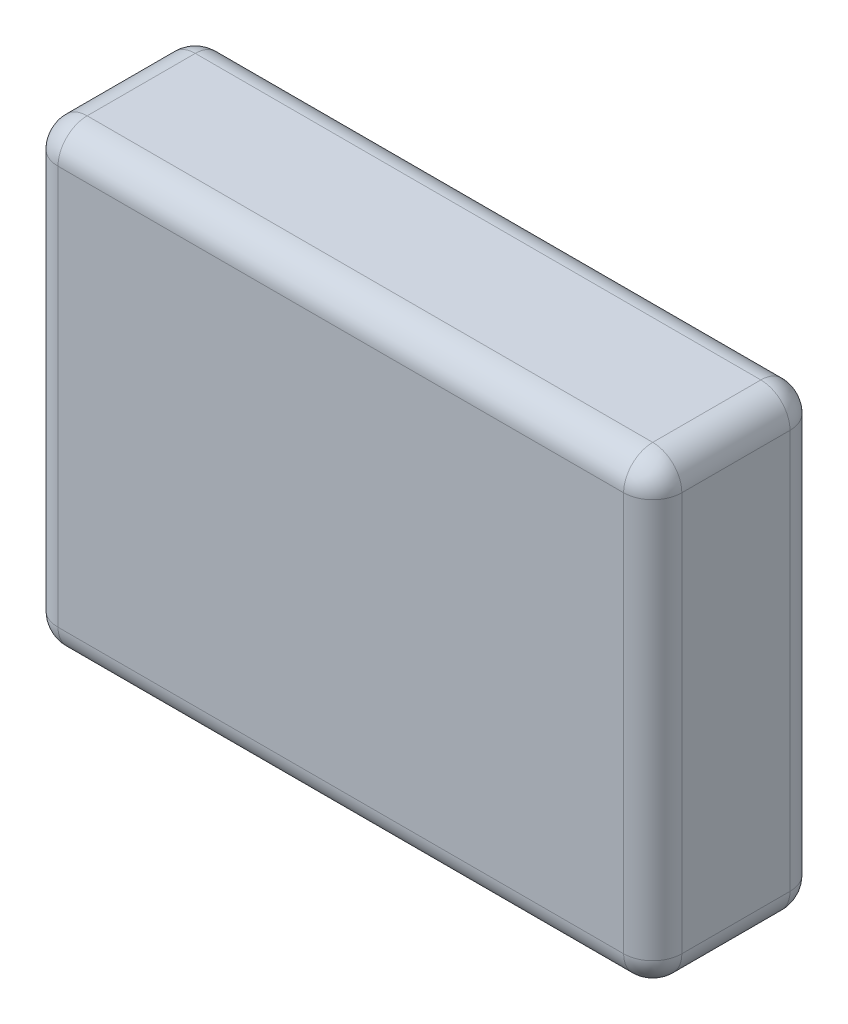
ISO-10303-21;
HEADER;
FILE_DESCRIPTION(('STEP AP214'),'2;1');
FILE_NAME('part.step','',(''),(''),'','','');
FILE_SCHEMA(('AUTOMOTIVE_DESIGN { 1 0 10303 214 1 1 1 1 }'));
ENDSEC;
DATA;
#1=APPLICATION_CONTEXT('core data for automotive mechanical design processes');
#2=APPLICATION_PROTOCOL_DEFINITION('international standard','automotive_design',2000,#1);
#3=PRODUCT_CONTEXT('',#1,'mechanical');
#4=PRODUCT('Part','Part','',(#3));
#5=PRODUCT_RELATED_PRODUCT_CATEGORY('part','',(#4));
#6=PRODUCT_DEFINITION_FORMATION('','',#4);
#7=PRODUCT_DEFINITION_CONTEXT('part definition',#1,'design');
#8=PRODUCT_DEFINITION('design','',#6,#7);
#9=PRODUCT_DEFINITION_SHAPE('','',#8);
#10=(LENGTH_UNIT() NAMED_UNIT(*) SI_UNIT(.MILLI.,.METRE.));
#11=(NAMED_UNIT(*) PLANE_ANGLE_UNIT() SI_UNIT($,.RADIAN.));
#12=(NAMED_UNIT(*) SI_UNIT($,.STERADIAN.) SOLID_ANGLE_UNIT());
#13=UNCERTAINTY_MEASURE_WITH_UNIT(LENGTH_MEASURE(1.E-05),#10,'distance_accuracy_value','');
#14=(GEOMETRIC_REPRESENTATION_CONTEXT(3) GLOBAL_UNCERTAINTY_ASSIGNED_CONTEXT((#13)) GLOBAL_UNIT_ASSIGNED_CONTEXT((#10,
#11,#12)) REPRESENTATION_CONTEXT('',''));
#15=CARTESIAN_POINT('',(0.,0.,0.));
#16=DIRECTION('',(0.,0.,1.));
#17=DIRECTION('',(1.,0.,0.));
#18=AXIS2_PLACEMENT_3D('',#15,#16,#17);
#19=CARTESIAN_POINT('',(375.,172.271573604061,200.));
#20=DIRECTION('',(-1.,0.,0.));
#21=DIRECTION('',(0.,0.,1.));
#22=AXIS2_PLACEMENT_3D('',#19,#20,#21);
#23=PLANE('',#22);
#24=DIRECTION('',(0.,0.,-1.));
#25=VECTOR('',#24,1.);
#26=CARTESIAN_POINT('',(375.,137.271573604061,200.));
#27=LINE('',#26,#25);
#28=CARTESIAN_POINT('',(375.,137.271573604061,35.));
#29=VERTEX_POINT('',#28);
#30=CARTESIAN_POINT('',(375.,137.271573604061,165.));
#31=VERTEX_POINT('',#30);
#32=EDGE_CURVE('E141',#29,#31,#27,.F.);
#33=ORIENTED_EDGE('',*,*,#32,.T.);
#34=DIRECTION('',(0.,1.,0.));
#35=VECTOR('',#34,1.);
#36=CARTESIAN_POINT('',(375.,-377.728426395939,165.));
#37=LINE('',#36,#35);
#38=CARTESIAN_POINT('',(375.,-342.728426395939,165.));
#39=VERTEX_POINT('',#38);
#40=EDGE_CURVE('E187',#31,#39,#37,.F.);
#41=ORIENTED_EDGE('',*,*,#40,.T.);
#42=DIRECTION('',(0.,0.,-1.));
#43=VECTOR('',#42,1.);
#44=CARTESIAN_POINT('',(375.,-342.728426395939,200.));
#45=LINE('',#44,#43);
#46=CARTESIAN_POINT('',(375.,-342.728426395939,35.));
#47=VERTEX_POINT('',#46);
#48=EDGE_CURVE('E182',#39,#47,#45,.T.);
#49=ORIENTED_EDGE('',*,*,#48,.T.);
#50=DIRECTION('',(0.,1.,0.));
#51=VECTOR('',#50,1.);
#52=CARTESIAN_POINT('',(375.,172.271573604061,35.));
#53=LINE('',#52,#51);
#54=EDGE_CURVE('E176',#47,#29,#53,.T.);
#55=ORIENTED_EDGE('',*,*,#54,.T.);
#56=EDGE_LOOP('',(#33,#41,#49,#55));
#57=FACE_BOUND('',#56,.T.);
#58=ADVANCED_FACE('F45',(#57),#23,.F.);
#59=CARTESIAN_POINT('',(-375.,172.271573604061,200.));
#60=DIRECTION('',(0.,-1.,0.));
#61=DIRECTION('',(0.,0.,-1.));
#62=AXIS2_PLACEMENT_3D('',#59,#60,#61);
#63=PLANE('',#62);
#64=DIRECTION('',(0.,0.,-1.));
#65=VECTOR('',#64,1.);
#66=CARTESIAN_POINT('',(-340.,172.271573604061,200.));
#67=LINE('',#66,#65);
#68=CARTESIAN_POINT('',(-340.,172.271573604061,35.));
#69=VERTEX_POINT('',#68);
#70=CARTESIAN_POINT('',(-340.,172.271573604061,165.));
#71=VERTEX_POINT('',#70);
#72=EDGE_CURVE('E166',#69,#71,#67,.F.);
#73=ORIENTED_EDGE('',*,*,#72,.T.);
#74=DIRECTION('',(-1.,0.,0.));
#75=VECTOR('',#74,1.);
#76=CARTESIAN_POINT('',(375.,172.271573604061,165.));
#77=LINE('',#76,#75);
#78=CARTESIAN_POINT('',(340.,172.271573604061,165.));
#79=VERTEX_POINT('',#78);
#80=EDGE_CURVE('E170',#71,#79,#77,.F.);
#81=ORIENTED_EDGE('',*,*,#80,.T.);
#82=DIRECTION('',(0.,0.,-1.));
#83=VECTOR('',#82,1.);
#84=CARTESIAN_POINT('',(340.,172.271573604061,200.));
#85=LINE('',#84,#83);
#86=CARTESIAN_POINT('',(340.,172.271573604061,35.));
#87=VERTEX_POINT('',#86);
#88=EDGE_CURVE('E139',#79,#87,#85,.T.);
#89=ORIENTED_EDGE('',*,*,#88,.T.);
#90=DIRECTION('',(-1.,0.,0.));
#91=VECTOR('',#90,1.);
#92=CARTESIAN_POINT('',(-375.,172.271573604061,35.));
#93=LINE('',#92,#91);
#94=EDGE_CURVE('E159',#87,#69,#93,.T.);
#95=ORIENTED_EDGE('',*,*,#94,.T.);
#96=EDGE_LOOP('',(#73,#81,#89,#95));
#97=FACE_BOUND('',#96,.T.);
#98=ADVANCED_FACE('F168',(#97),#63,.F.);
#99=CARTESIAN_POINT('',(-375.,172.271573604061,200.));
#100=DIRECTION('',(1.,0.,0.));
#101=DIRECTION('',(0.,0.,-1.));
#102=AXIS2_PLACEMENT_3D('',#99,#100,#101);
#103=PLANE('',#102);
#104=DIRECTION('',(0.,0.,-1.));
#105=VECTOR('',#104,1.);
#106=CARTESIAN_POINT('',(-375.,-342.728426395939,200.));
#107=LINE('',#106,#105);
#108=CARTESIAN_POINT('',(-375.,-342.728426395939,35.));
#109=VERTEX_POINT('',#108);
#110=CARTESIAN_POINT('',(-375.,-342.728426395939,165.));
#111=VERTEX_POINT('',#110);
#112=EDGE_CURVE('E193',#109,#111,#107,.F.);
#113=ORIENTED_EDGE('',*,*,#112,.T.);
#114=DIRECTION('',(0.,-1.,0.));
#115=VECTOR('',#114,1.);
#116=CARTESIAN_POINT('',(-375.,172.271573604061,165.));
#117=LINE('',#116,#115);
#118=CARTESIAN_POINT('',(-375.,137.271573604061,165.));
#119=VERTEX_POINT('',#118);
#120=EDGE_CURVE('E200',#111,#119,#117,.F.);
#121=ORIENTED_EDGE('',*,*,#120,.T.);
#122=DIRECTION('',(0.,0.,-1.));
#123=VECTOR('',#122,1.);
#124=CARTESIAN_POINT('',(-375.,137.271573604061,200.));
#125=LINE('',#124,#123);
#126=CARTESIAN_POINT('',(-375.,137.271573604061,35.));
#127=VERTEX_POINT('',#126);
#128=EDGE_CURVE('E196',#119,#127,#125,.T.);
#129=ORIENTED_EDGE('',*,*,#128,.T.);
#130=DIRECTION('',(0.,-1.,0.));
#131=VECTOR('',#130,1.);
#132=CARTESIAN_POINT('',(-375.,172.271573604061,35.));
#133=LINE('',#132,#131);
#134=EDGE_CURVE('E190',#127,#109,#133,.T.);
#135=ORIENTED_EDGE('',*,*,#134,.T.);
#136=EDGE_LOOP('',(#113,#121,#129,#135));
#137=FACE_BOUND('',#136,.T.);
#138=ADVANCED_FACE('F339',(#137),#103,.F.);
#139=CARTESIAN_POINT('',(-375.,-377.728426395939,200.));
#140=DIRECTION('',(0.,1.,0.));
#141=DIRECTION('',(0.,0.,1.));
#142=AXIS2_PLACEMENT_3D('',#139,#140,#141);
#143=PLANE('',#142);
#144=DIRECTION('',(0.,0.,-1.));
#145=VECTOR('',#144,1.);
#146=CARTESIAN_POINT('',(340.,-377.728426395939,200.));
#147=LINE('',#146,#145);
#148=CARTESIAN_POINT('',(340.,-377.728426395939,35.));
#149=VERTEX_POINT('',#148);
#150=CARTESIAN_POINT('',(340.,-377.728426395939,165.));
#151=VERTEX_POINT('',#150);
#152=EDGE_CURVE('E206',#149,#151,#147,.F.);
#153=ORIENTED_EDGE('',*,*,#152,.T.);
#154=DIRECTION('',(1.,0.,0.));
#155=VECTOR('',#154,1.);
#156=CARTESIAN_POINT('',(-375.,-377.728426395939,165.));
#157=LINE('',#156,#155);
#158=CARTESIAN_POINT('',(-340.,-377.728426395939,165.));
#159=VERTEX_POINT('',#158);
#160=EDGE_CURVE('E213',#151,#159,#157,.F.);
#161=ORIENTED_EDGE('',*,*,#160,.T.);
#162=DIRECTION('',(0.,0.,-1.));
#163=VECTOR('',#162,1.);
#164=CARTESIAN_POINT('',(-340.,-377.728426395939,200.));
#165=LINE('',#164,#163);
#166=CARTESIAN_POINT('',(-340.,-377.728426395939,35.));
#167=VERTEX_POINT('',#166);
#168=EDGE_CURVE('E209',#159,#167,#165,.T.);
#169=ORIENTED_EDGE('',*,*,#168,.T.);
#170=DIRECTION('',(1.,0.,0.));
#171=VECTOR('',#170,1.);
#172=CARTESIAN_POINT('',(-375.,-377.728426395939,35.));
#173=LINE('',#172,#171);
#174=EDGE_CURVE('E203',#167,#149,#173,.T.);
#175=ORIENTED_EDGE('',*,*,#174,.T.);
#176=EDGE_LOOP('',(#153,#161,#169,#175));
#177=FACE_BOUND('',#176,.T.);
#178=ADVANCED_FACE('F349',(#177),#143,.F.);
#179=CARTESIAN_POINT('',(0.,0.,200.));
#180=DIRECTION('',(0.,0.,1.));
#181=DIRECTION('',(1.,0.,0.));
#182=AXIS2_PLACEMENT_3D('',#179,#180,#181);
#183=PLANE('',#182);
#184=DIRECTION('',(0.,-1.,0.));
#185=VECTOR('',#184,1.);
#186=CARTESIAN_POINT('',(-340.,-377.728426395939,200.));
#187=LINE('',#186,#185);
#188=CARTESIAN_POINT('',(-340.,137.271573604061,200.));
#189=VERTEX_POINT('',#188);
#190=CARTESIAN_POINT('',(-340.,-342.728426395939,200.));
#191=VERTEX_POINT('',#190);
#192=EDGE_CURVE('E222',#189,#191,#187,.T.);
#193=ORIENTED_EDGE('',*,*,#192,.T.);
#194=DIRECTION('',(1.,0.,0.));
#195=VECTOR('',#194,1.);
#196=CARTESIAN_POINT('',(375.,-342.728426395939,200.));
#197=LINE('',#196,#195);
#198=CARTESIAN_POINT('',(340.,-342.728426395939,200.));
#199=VERTEX_POINT('',#198);
#200=EDGE_CURVE('E225',#191,#199,#197,.T.);
#201=ORIENTED_EDGE('',*,*,#200,.T.);
#202=DIRECTION('',(0.,1.,0.));
#203=VECTOR('',#202,1.);
#204=CARTESIAN_POINT('',(340.,172.271573604061,200.));
#205=LINE('',#204,#203);
#206=CARTESIAN_POINT('',(340.,137.271573604061,200.));
#207=VERTEX_POINT('',#206);
#208=EDGE_CURVE('E216',#199,#207,#205,.T.);
#209=ORIENTED_EDGE('',*,*,#208,.T.);
#210=DIRECTION('',(-1.,0.,0.));
#211=VECTOR('',#210,1.);
#212=CARTESIAN_POINT('',(-375.,137.271573604061,200.));
#213=LINE('',#212,#211);
#214=EDGE_CURVE('E219',#207,#189,#213,.T.);
#215=ORIENTED_EDGE('',*,*,#214,.T.);
#216=EDGE_LOOP('',(#193,#201,#209,#215));
#217=FACE_BOUND('',#216,.T.);
#218=ADVANCED_FACE('F331',(#217),#183,.T.);
#219=CARTESIAN_POINT('',(0.,0.,0.));
#220=DIRECTION('',(0.,0.,1.));
#221=DIRECTION('',(1.,0.,0.));
#222=AXIS2_PLACEMENT_3D('',#219,#220,#221);
#223=PLANE('',#222);
#224=DIRECTION('',(0.,1.,0.));
#225=VECTOR('',#224,1.);
#226=CARTESIAN_POINT('',(340.,0.,0.));
#227=LINE('',#226,#225);
#228=CARTESIAN_POINT('',(340.,137.271573604061,0.));
#229=VERTEX_POINT('',#228);
#230=CARTESIAN_POINT('',(340.,-342.728426395939,0.));
#231=VERTEX_POINT('',#230);
#232=EDGE_CURVE('E229',#229,#231,#227,.F.);
#233=ORIENTED_EDGE('',*,*,#232,.T.);
#234=DIRECTION('',(1.,0.,0.));
#235=VECTOR('',#234,1.);
#236=CARTESIAN_POINT('',(0.,-342.728426395939,0.));
#237=LINE('',#236,#235);
#238=CARTESIAN_POINT('',(-340.,-342.728426395939,0.));
#239=VERTEX_POINT('',#238);
#240=EDGE_CURVE('E11',#231,#239,#237,.F.);
#241=ORIENTED_EDGE('',*,*,#240,.T.);
#242=DIRECTION('',(0.,-1.,0.));
#243=VECTOR('',#242,1.);
#244=CARTESIAN_POINT('',(-340.,0.,0.));
#245=LINE('',#244,#243);
#246=CARTESIAN_POINT('',(-340.,137.271573604061,0.));
#247=VERTEX_POINT('',#246);
#248=EDGE_CURVE('E55',#239,#247,#245,.F.);
#249=ORIENTED_EDGE('',*,*,#248,.T.);
#250=DIRECTION('',(-1.,0.,0.));
#251=VECTOR('',#250,1.);
#252=CARTESIAN_POINT('',(0.,137.271573604061,0.));
#253=LINE('',#252,#251);
#254=EDGE_CURVE('E232',#247,#229,#253,.F.);
#255=ORIENTED_EDGE('',*,*,#254,.T.);
#256=EDGE_LOOP('',(#233,#241,#249,#255));
#257=FACE_BOUND('',#256,.T.);
#258=ADVANCED_FACE('F577',(#257),#223,.F.);
#259=CARTESIAN_POINT('',(-340.,-342.728426395939,200.));
#260=DIRECTION('',(0.,0.,-1.));
#261=DIRECTION('',(-1.,0.,0.));
#262=AXIS2_PLACEMENT_3D('',#259,#260,#261);
#263=CYLINDRICAL_SURFACE('',#262,35.);
#264=CARTESIAN_POINT('',(-340.,-342.728426395939,165.));
#265=DIRECTION('',(0.,0.,1.));
#266=DIRECTION('',(1.,0.,0.));
#267=AXIS2_PLACEMENT_3D('',#264,#265,#266);
#268=CIRCLE('',#267,35.);
#269=EDGE_CURVE('E49',#111,#159,#268,.T.);
#270=ORIENTED_EDGE('',*,*,#269,.F.);
#271=ORIENTED_EDGE('',*,*,#112,.F.);
#272=CARTESIAN_POINT('',(-340.,-342.728426395939,35.));
#273=DIRECTION('',(0.,0.,-1.));
#274=DIRECTION('',(-1.,0.,0.));
#275=AXIS2_PLACEMENT_3D('',#272,#273,#274);
#276=CIRCLE('',#275,35.);
#277=EDGE_CURVE('E307',#167,#109,#276,.T.);
#278=ORIENTED_EDGE('',*,*,#277,.F.);
#279=ORIENTED_EDGE('',*,*,#168,.F.);
#280=EDGE_LOOP('',(#270,#271,#278,#279));
#281=FACE_BOUND('',#280,.T.);
#282=ADVANCED_FACE('F47',(#281),#263,.T.);
#283=CARTESIAN_POINT('',(-340.,-342.728426395939,165.));
#284=DIRECTION('',(0.,-1.,0.));
#285=DIRECTION('',(0.,0.,-1.));
#286=AXIS2_PLACEMENT_3D('',#283,#284,#285);
#287=SPHERICAL_SURFACE('',#286,35.);
#288=CARTESIAN_POINT('',(-340.,-342.728426395939,165.));
#289=DIRECTION('',(0.,-1.,0.));
#290=DIRECTION('',(0.,0.,-1.));
#291=AXIS2_PLACEMENT_3D('',#288,#289,#290);
#292=CIRCLE('',#291,35.);
#293=EDGE_CURVE('E300',#111,#191,#292,.F.);
#294=ORIENTED_EDGE('',*,*,#293,.F.);
#295=ORIENTED_EDGE('',*,*,#269,.T.);
#296=CARTESIAN_POINT('',(-340.,-342.728426395939,165.));
#297=DIRECTION('',(-1.,0.,0.));
#298=DIRECTION('',(0.,0.,1.));
#299=AXIS2_PLACEMENT_3D('',#296,#297,#298);
#300=CIRCLE('',#299,35.);
#301=EDGE_CURVE('E304',#191,#159,#300,.F.);
#302=ORIENTED_EDGE('',*,*,#301,.F.);
#303=EDGE_LOOP('',(#294,#295,#302));
#304=FACE_BOUND('',#303,.T.);
#305=ADVANCED_FACE('F319',(#304),#287,.T.);
#306=CARTESIAN_POINT('',(-340.,-342.728426395939,35.));
#307=DIRECTION('',(-1.,0.,0.));
#308=DIRECTION('',(0.,0.,1.));
#309=AXIS2_PLACEMENT_3D('',#306,#307,#308);
#310=SPHERICAL_SURFACE('',#309,35.);
#311=CARTESIAN_POINT('',(-340.,-342.728426395939,35.));
#312=DIRECTION('',(-1.,0.,0.));
#313=DIRECTION('',(0.,0.,1.));
#314=AXIS2_PLACEMENT_3D('',#311,#312,#313);
#315=CIRCLE('',#314,35.);
#316=EDGE_CURVE('E293',#167,#239,#315,.F.);
#317=ORIENTED_EDGE('',*,*,#316,.F.);
#318=ORIENTED_EDGE('',*,*,#277,.T.);
#319=CARTESIAN_POINT('',(-340.,-342.728426395939,35.));
#320=DIRECTION('',(0.,-1.,0.));
#321=DIRECTION('',(0.,0.,-1.));
#322=AXIS2_PLACEMENT_3D('',#319,#320,#321);
#323=CIRCLE('',#322,35.);
#324=EDGE_CURVE('E297',#239,#109,#323,.F.);
#325=ORIENTED_EDGE('',*,*,#324,.F.);
#326=EDGE_LOOP('',(#317,#318,#325));
#327=FACE_BOUND('',#326,.T.);
#328=ADVANCED_FACE('F550',(#327),#310,.T.);
#329=CARTESIAN_POINT('',(0.,-342.728426395939,165.));
#330=DIRECTION('',(-1.,0.,0.));
#331=DIRECTION('',(0.,0.,1.));
#332=AXIS2_PLACEMENT_3D('',#329,#330,#331);
#333=CYLINDRICAL_SURFACE('',#332,35.);
#334=ORIENTED_EDGE('',*,*,#301,.T.);
#335=ORIENTED_EDGE('',*,*,#160,.F.);
#336=CARTESIAN_POINT('',(340.,-342.728426395939,165.));
#337=DIRECTION('',(1.,0.,0.));
#338=DIRECTION('',(0.,0.,-1.));
#339=AXIS2_PLACEMENT_3D('',#336,#337,#338);
#340=CIRCLE('',#339,35.);
#341=EDGE_CURVE('E285',#199,#151,#340,.T.);
#342=ORIENTED_EDGE('',*,*,#341,.F.);
#343=ORIENTED_EDGE('',*,*,#200,.F.);
#344=EDGE_LOOP('',(#334,#335,#342,#343));
#345=FACE_BOUND('',#344,.T.);
#346=ADVANCED_FACE('F327',(#345),#333,.T.);
#347=CARTESIAN_POINT('',(-340.,0.,165.));
#348=DIRECTION('',(0.,1.,0.));
#349=DIRECTION('',(0.,0.,1.));
#350=AXIS2_PLACEMENT_3D('',#347,#348,#349);
#351=CYLINDRICAL_SURFACE('',#350,35.);
#352=ORIENTED_EDGE('',*,*,#293,.T.);
#353=ORIENTED_EDGE('',*,*,#192,.F.);
#354=CARTESIAN_POINT('',(-340.,137.271573604061,165.));
#355=DIRECTION('',(0.,1.,0.));
#356=DIRECTION('',(0.,0.,1.));
#357=AXIS2_PLACEMENT_3D('',#354,#355,#356);
#358=CIRCLE('',#357,35.);
#359=EDGE_CURVE('E281',#119,#189,#358,.T.);
#360=ORIENTED_EDGE('',*,*,#359,.F.);
#361=ORIENTED_EDGE('',*,*,#120,.F.);
#362=EDGE_LOOP('',(#352,#353,#360,#361));
#363=FACE_BOUND('',#362,.T.);
#364=ADVANCED_FACE('F336',(#363),#351,.T.);
#365=CARTESIAN_POINT('',(-340.,137.271573604061,200.));
#366=DIRECTION('',(0.,0.,-1.));
#367=DIRECTION('',(-1.,0.,0.));
#368=AXIS2_PLACEMENT_3D('',#365,#366,#367);
#369=CYLINDRICAL_SURFACE('',#368,35.);
#370=CARTESIAN_POINT('',(-340.,137.271573604061,35.));
#371=DIRECTION('',(0.,0.,-1.));
#372=DIRECTION('',(-1.,0.,0.));
#373=AXIS2_PLACEMENT_3D('',#370,#371,#372);
#374=CIRCLE('',#373,35.);
#375=EDGE_CURVE('E273',#127,#69,#374,.T.);
#376=ORIENTED_EDGE('',*,*,#375,.F.);
#377=ORIENTED_EDGE('',*,*,#128,.F.);
#378=CARTESIAN_POINT('',(-340.,137.271573604061,165.));
#379=DIRECTION('',(0.,0.,1.));
#380=DIRECTION('',(1.,0.,0.));
#381=AXIS2_PLACEMENT_3D('',#378,#379,#380);
#382=CIRCLE('',#381,35.);
#383=EDGE_CURVE('E277',#71,#119,#382,.T.);
#384=ORIENTED_EDGE('',*,*,#383,.F.);
#385=ORIENTED_EDGE('',*,*,#72,.F.);
#386=EDGE_LOOP('',(#376,#377,#384,#385));
#387=FACE_BOUND('',#386,.T.);
#388=ADVANCED_FACE('F343',(#387),#369,.T.);
#389=CARTESIAN_POINT('',(-340.,172.271573604061,35.));
#390=DIRECTION('',(0.,-1.,0.));
#391=DIRECTION('',(0.,0.,-1.));
#392=AXIS2_PLACEMENT_3D('',#389,#390,#391);
#393=CYLINDRICAL_SURFACE('',#392,35.);
#394=ORIENTED_EDGE('',*,*,#324,.T.);
#395=ORIENTED_EDGE('',*,*,#134,.F.);
#396=CARTESIAN_POINT('',(-340.,137.271573604061,35.));
#397=DIRECTION('',(0.,1.,0.));
#398=DIRECTION('',(0.,0.,1.));
#399=AXIS2_PLACEMENT_3D('',#396,#397,#398);
#400=CIRCLE('',#399,35.);
#401=EDGE_CURVE('E270',#247,#127,#400,.T.);
#402=ORIENTED_EDGE('',*,*,#401,.F.);
#403=ORIENTED_EDGE('',*,*,#248,.F.);
#404=EDGE_LOOP('',(#394,#395,#402,#403));
#405=FACE_BOUND('',#404,.T.);
#406=ADVANCED_FACE('F347',(#405),#393,.T.);
#407=CARTESIAN_POINT('',(-375.,-342.728426395939,35.));
#408=DIRECTION('',(1.,0.,0.));
#409=DIRECTION('',(0.,0.,-1.));
#410=AXIS2_PLACEMENT_3D('',#407,#408,#409);
#411=CYLINDRICAL_SURFACE('',#410,35.);
#412=ORIENTED_EDGE('',*,*,#316,.T.);
#413=ORIENTED_EDGE('',*,*,#240,.F.);
#414=CARTESIAN_POINT('',(340.,-342.728426395939,35.));
#415=DIRECTION('',(1.,0.,0.));
#416=DIRECTION('',(0.,0.,-1.));
#417=AXIS2_PLACEMENT_3D('',#414,#415,#416);
#418=CIRCLE('',#417,35.);
#419=EDGE_CURVE('E266',#149,#231,#418,.T.);
#420=ORIENTED_EDGE('',*,*,#419,.F.);
#421=ORIENTED_EDGE('',*,*,#174,.F.);
#422=EDGE_LOOP('',(#412,#413,#420,#421));
#423=FACE_BOUND('',#422,.T.);
#424=ADVANCED_FACE('F359',(#423),#411,.T.);
#425=CARTESIAN_POINT('',(340.,-342.728426395939,200.));
#426=DIRECTION('',(0.,0.,-1.));
#427=DIRECTION('',(-1.,0.,0.));
#428=AXIS2_PLACEMENT_3D('',#425,#426,#427);
#429=CYLINDRICAL_SURFACE('',#428,35.);
#430=CARTESIAN_POINT('',(340.,-342.728426395939,165.));
#431=DIRECTION('',(0.,0.,1.));
#432=DIRECTION('',(1.,0.,0.));
#433=AXIS2_PLACEMENT_3D('',#430,#431,#432);
#434=CIRCLE('',#433,35.);
#435=EDGE_CURVE('E289',#151,#39,#434,.T.);
#436=ORIENTED_EDGE('',*,*,#435,.F.);
#437=ORIENTED_EDGE('',*,*,#152,.F.);
#438=CARTESIAN_POINT('',(340.,-342.728426395939,35.));
#439=DIRECTION('',(0.,0.,-1.));
#440=DIRECTION('',(-1.,0.,0.));
#441=AXIS2_PLACEMENT_3D('',#438,#439,#440);
#442=CIRCLE('',#441,35.);
#443=EDGE_CURVE('E262',#47,#149,#442,.T.);
#444=ORIENTED_EDGE('',*,*,#443,.F.);
#445=ORIENTED_EDGE('',*,*,#48,.F.);
#446=EDGE_LOOP('',(#436,#437,#444,#445));
#447=FACE_BOUND('',#446,.T.);
#448=ADVANCED_FACE('F354',(#447),#429,.T.);
#449=CARTESIAN_POINT('',(340.,-342.728426395939,165.));
#450=DIRECTION('',(0.,-1.,0.));
#451=DIRECTION('',(0.,0.,-1.));
#452=AXIS2_PLACEMENT_3D('',#449,#450,#451);
#453=SPHERICAL_SURFACE('',#452,35.);
#454=ORIENTED_EDGE('',*,*,#341,.T.);
#455=ORIENTED_EDGE('',*,*,#435,.T.);
#456=CARTESIAN_POINT('',(340.,-342.728426395939,165.));
#457=DIRECTION('',(0.,-1.,0.));
#458=DIRECTION('',(0.,0.,-1.));
#459=AXIS2_PLACEMENT_3D('',#456,#457,#458);
#460=CIRCLE('',#459,35.);
#461=EDGE_CURVE('E258',#199,#39,#460,.F.);
#462=ORIENTED_EDGE('',*,*,#461,.F.);
#463=EDGE_LOOP('',(#454,#455,#462));
#464=FACE_BOUND('',#463,.T.);
#465=ADVANCED_FACE('F370',(#464),#453,.T.);
#466=CARTESIAN_POINT('',(-340.,137.271573604061,165.));
#467=DIRECTION('',(-1.,0.,0.));
#468=DIRECTION('',(0.,0.,1.));
#469=AXIS2_PLACEMENT_3D('',#466,#467,#468);
#470=SPHERICAL_SURFACE('',#469,35.);
#471=ORIENTED_EDGE('',*,*,#383,.T.);
#472=ORIENTED_EDGE('',*,*,#359,.T.);
#473=CARTESIAN_POINT('',(-340.,137.271573604061,165.));
#474=DIRECTION('',(-1.,0.,0.));
#475=DIRECTION('',(0.,0.,1.));
#476=AXIS2_PLACEMENT_3D('',#473,#474,#475);
#477=CIRCLE('',#476,35.);
#478=EDGE_CURVE('E254',#71,#189,#477,.F.);
#479=ORIENTED_EDGE('',*,*,#478,.F.);
#480=EDGE_LOOP('',(#471,#472,#479));
#481=FACE_BOUND('',#480,.T.);
#482=ADVANCED_FACE('F380',(#481),#470,.T.);
#483=CARTESIAN_POINT('',(-340.,137.271573604061,35.));
#484=DIRECTION('',(-1.,0.,0.));
#485=DIRECTION('',(0.,0.,1.));
#486=AXIS2_PLACEMENT_3D('',#483,#484,#485);
#487=SPHERICAL_SURFACE('',#486,35.);
#488=ORIENTED_EDGE('',*,*,#401,.T.);
#489=ORIENTED_EDGE('',*,*,#375,.T.);
#490=CARTESIAN_POINT('',(-340.,137.271573604061,35.));
#491=DIRECTION('',(-1.,0.,0.));
#492=DIRECTION('',(0.,0.,1.));
#493=AXIS2_PLACEMENT_3D('',#490,#491,#492);
#494=CIRCLE('',#493,35.);
#495=EDGE_CURVE('E162',#247,#69,#494,.F.);
#496=ORIENTED_EDGE('',*,*,#495,.F.);
#497=EDGE_LOOP('',(#488,#489,#496));
#498=FACE_BOUND('',#497,.T.);
#499=ADVANCED_FACE('F382',(#498),#487,.T.);
#500=CARTESIAN_POINT('',(340.,-342.728426395939,35.));
#501=DIRECTION('',(0.,-1.,0.));
#502=DIRECTION('',(0.,0.,-1.));
#503=AXIS2_PLACEMENT_3D('',#500,#501,#502);
#504=SPHERICAL_SURFACE('',#503,35.);
#505=ORIENTED_EDGE('',*,*,#443,.T.);
#506=ORIENTED_EDGE('',*,*,#419,.T.);
#507=CARTESIAN_POINT('',(340.,-342.728426395939,35.));
#508=DIRECTION('',(0.,-1.,0.));
#509=DIRECTION('',(0.,0.,-1.));
#510=AXIS2_PLACEMENT_3D('',#507,#508,#509);
#511=CIRCLE('',#510,35.);
#512=EDGE_CURVE('E248',#47,#231,#511,.F.);
#513=ORIENTED_EDGE('',*,*,#512,.F.);
#514=EDGE_LOOP('',(#505,#506,#513));
#515=FACE_BOUND('',#514,.T.);
#516=ADVANCED_FACE('F361',(#515),#504,.T.);
#517=CARTESIAN_POINT('',(340.,0.,165.));
#518=DIRECTION('',(0.,-1.,0.));
#519=DIRECTION('',(0.,0.,-1.));
#520=AXIS2_PLACEMENT_3D('',#517,#518,#519);
#521=CYLINDRICAL_SURFACE('',#520,35.);
#522=ORIENTED_EDGE('',*,*,#461,.T.);
#523=ORIENTED_EDGE('',*,*,#40,.F.);
#524=CARTESIAN_POINT('',(340.,137.271573604061,165.));
#525=DIRECTION('',(0.,1.,0.));
#526=DIRECTION('',(0.,0.,1.));
#527=AXIS2_PLACEMENT_3D('',#524,#525,#526);
#528=CIRCLE('',#527,35.);
#529=EDGE_CURVE('E244',#207,#31,#528,.T.);
#530=ORIENTED_EDGE('',*,*,#529,.F.);
#531=ORIENTED_EDGE('',*,*,#208,.F.);
#532=EDGE_LOOP('',(#522,#523,#530,#531));
#533=FACE_BOUND('',#532,.T.);
#534=ADVANCED_FACE('F372',(#533),#521,.T.);
#535=CARTESIAN_POINT('',(0.,137.271573604061,165.));
#536=DIRECTION('',(1.,0.,0.));
#537=DIRECTION('',(0.,0.,-1.));
#538=AXIS2_PLACEMENT_3D('',#535,#536,#537);
#539=CYLINDRICAL_SURFACE('',#538,35.);
#540=ORIENTED_EDGE('',*,*,#478,.T.);
#541=ORIENTED_EDGE('',*,*,#214,.F.);
#542=CARTESIAN_POINT('',(340.,137.271573604061,165.));
#543=DIRECTION('',(1.,0.,0.));
#544=DIRECTION('',(0.,0.,-1.));
#545=AXIS2_PLACEMENT_3D('',#542,#543,#544);
#546=CIRCLE('',#545,35.);
#547=EDGE_CURVE('E156',#79,#207,#546,.T.);
#548=ORIENTED_EDGE('',*,*,#547,.F.);
#549=ORIENTED_EDGE('',*,*,#80,.F.);
#550=EDGE_LOOP('',(#540,#541,#548,#549));
#551=FACE_BOUND('',#550,.T.);
#552=ADVANCED_FACE('F378',(#551),#539,.T.);
#553=CARTESIAN_POINT('',(-375.,137.271573604061,35.));
#554=DIRECTION('',(-1.,0.,0.));
#555=DIRECTION('',(0.,0.,1.));
#556=AXIS2_PLACEMENT_3D('',#553,#554,#555);
#557=CYLINDRICAL_SURFACE('',#556,35.);
#558=ORIENTED_EDGE('',*,*,#495,.T.);
#559=ORIENTED_EDGE('',*,*,#94,.F.);
#560=CARTESIAN_POINT('',(340.,137.271573604061,35.));
#561=DIRECTION('',(1.,0.,0.));
#562=DIRECTION('',(0.,0.,-1.));
#563=AXIS2_PLACEMENT_3D('',#560,#561,#562);
#564=CIRCLE('',#563,35.);
#565=EDGE_CURVE('E148',#229,#87,#564,.T.);
#566=ORIENTED_EDGE('',*,*,#565,.F.);
#567=ORIENTED_EDGE('',*,*,#254,.F.);
#568=EDGE_LOOP('',(#558,#559,#566,#567));
#569=FACE_BOUND('',#568,.T.);
#570=ADVANCED_FACE('F160',(#569),#557,.T.);
#571=CARTESIAN_POINT('',(340.,172.271573604061,35.));
#572=DIRECTION('',(0.,1.,0.));
#573=DIRECTION('',(0.,0.,1.));
#574=AXIS2_PLACEMENT_3D('',#571,#572,#573);
#575=CYLINDRICAL_SURFACE('',#574,35.);
#576=ORIENTED_EDGE('',*,*,#512,.T.);
#577=ORIENTED_EDGE('',*,*,#232,.F.);
#578=CARTESIAN_POINT('',(340.,137.271573604061,35.));
#579=DIRECTION('',(0.,1.,0.));
#580=DIRECTION('',(0.,0.,1.));
#581=AXIS2_PLACEMENT_3D('',#578,#579,#580);
#582=CIRCLE('',#581,35.);
#583=EDGE_CURVE('E152',#29,#229,#582,.T.);
#584=ORIENTED_EDGE('',*,*,#583,.F.);
#585=ORIENTED_EDGE('',*,*,#54,.F.);
#586=EDGE_LOOP('',(#576,#577,#584,#585));
#587=FACE_BOUND('',#586,.T.);
#588=ADVANCED_FACE('F365',(#587),#575,.T.);
#589=CARTESIAN_POINT('',(340.,137.271573604061,165.));
#590=DIRECTION('',(0.,0.,1.));
#591=DIRECTION('',(1.,0.,0.));
#592=AXIS2_PLACEMENT_3D('',#589,#590,#591);
#593=SPHERICAL_SURFACE('',#592,35.);
#594=ORIENTED_EDGE('',*,*,#547,.T.);
#595=ORIENTED_EDGE('',*,*,#529,.T.);
#596=CARTESIAN_POINT('',(340.,137.271573604061,165.));
#597=DIRECTION('',(0.,0.,1.));
#598=DIRECTION('',(1.,0.,0.));
#599=AXIS2_PLACEMENT_3D('',#596,#597,#598);
#600=CIRCLE('',#599,35.);
#601=EDGE_CURVE('E145',#79,#31,#600,.F.);
#602=ORIENTED_EDGE('',*,*,#601,.F.);
#603=EDGE_LOOP('',(#594,#595,#602));
#604=FACE_BOUND('',#603,.T.);
#605=ADVANCED_FACE('F376',(#604),#593,.T.);
#606=CARTESIAN_POINT('',(340.,137.271573604061,35.));
#607=DIRECTION('',(0.,0.,-1.));
#608=DIRECTION('',(-1.,0.,0.));
#609=AXIS2_PLACEMENT_3D('',#606,#607,#608);
#610=SPHERICAL_SURFACE('',#609,35.);
#611=ORIENTED_EDGE('',*,*,#583,.T.);
#612=ORIENTED_EDGE('',*,*,#565,.T.);
#613=CARTESIAN_POINT('',(340.,137.271573604061,35.));
#614=DIRECTION('',(0.,0.,-1.));
#615=DIRECTION('',(-1.,0.,0.));
#616=AXIS2_PLACEMENT_3D('',#613,#614,#615);
#617=CIRCLE('',#616,35.);
#618=EDGE_CURVE('E135',#29,#87,#617,.F.);
#619=ORIENTED_EDGE('',*,*,#618,.F.);
#620=EDGE_LOOP('',(#611,#612,#619));
#621=FACE_BOUND('',#620,.T.);
#622=ADVANCED_FACE('F150',(#621),#610,.T.);
#623=CARTESIAN_POINT('',(340.,137.271573604061,200.));
#624=DIRECTION('',(0.,0.,-1.));
#625=DIRECTION('',(-1.,0.,0.));
#626=AXIS2_PLACEMENT_3D('',#623,#624,#625);
#627=CYLINDRICAL_SURFACE('',#626,35.);
#628=ORIENTED_EDGE('',*,*,#601,.T.);
#629=ORIENTED_EDGE('',*,*,#32,.F.);
#630=ORIENTED_EDGE('',*,*,#618,.T.);
#631=ORIENTED_EDGE('',*,*,#88,.F.);
#632=EDGE_LOOP('',(#628,#629,#630,#631));
#633=FACE_BOUND('',#632,.T.);
#634=ADVANCED_FACE('F137',(#633),#627,.T.);
#635=CLOSED_SHELL('',(#58,#98,#138,#178,#218,#258,#282,#305,#328,#346,#364,#388,#406,#424,#448,
#465,#482,#499,#516,#534,#552,#570,#588,#605,#622,#634));
#636=MANIFOLD_SOLID_BREP('B2',#635);
#637=ADVANCED_BREP_SHAPE_REPRESENTATION('',(#18,#636),#14);
#638=SHAPE_DEFINITION_REPRESENTATION(#9,#637);
ENDSEC;
END-ISO-10303-21;
